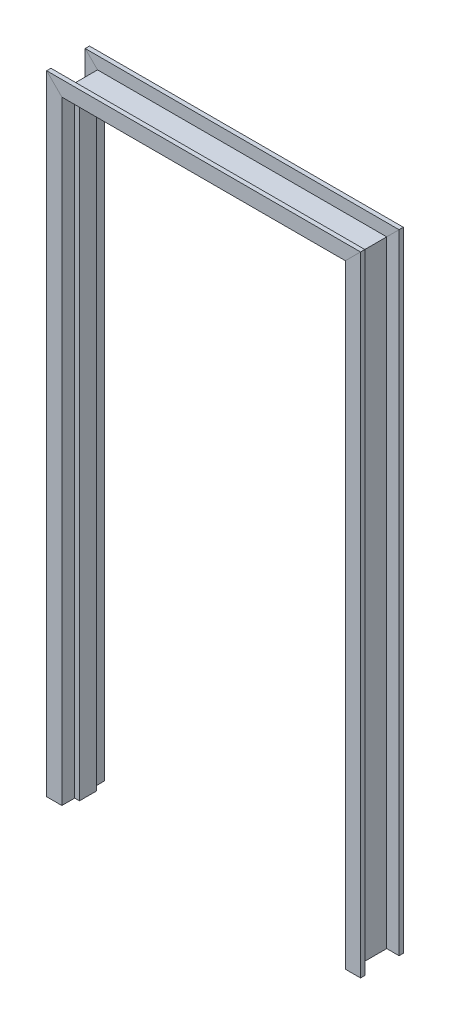
ISO-10303-21;
HEADER;
FILE_DESCRIPTION(('STEP AP214'),'2;1');
FILE_NAME('part.step','',(''),(''),'','','');
FILE_SCHEMA(('AUTOMOTIVE_DESIGN { 1 0 10303 214 1 1 1 1 }'));
ENDSEC;
DATA;
#1=APPLICATION_CONTEXT('core data for automotive mechanical design processes');
#2=APPLICATION_PROTOCOL_DEFINITION('international standard','automotive_design',2000,#1);
#3=PRODUCT_CONTEXT('',#1,'mechanical');
#4=PRODUCT('Part','Part','',(#3));
#5=PRODUCT_RELATED_PRODUCT_CATEGORY('part','',(#4));
#6=PRODUCT_DEFINITION_FORMATION('','',#4);
#7=PRODUCT_DEFINITION_CONTEXT('part definition',#1,'design');
#8=PRODUCT_DEFINITION('design','',#6,#7);
#9=PRODUCT_DEFINITION_SHAPE('','',#8);
#10=(LENGTH_UNIT() NAMED_UNIT(*) SI_UNIT(.MILLI.,.METRE.));
#11=(NAMED_UNIT(*) PLANE_ANGLE_UNIT() SI_UNIT($,.RADIAN.));
#12=(NAMED_UNIT(*) SI_UNIT($,.STERADIAN.) SOLID_ANGLE_UNIT());
#13=UNCERTAINTY_MEASURE_WITH_UNIT(LENGTH_MEASURE(1.E-05),#10,'distance_accuracy_value','');
#14=(GEOMETRIC_REPRESENTATION_CONTEXT(3) GLOBAL_UNCERTAINTY_ASSIGNED_CONTEXT((#13)) GLOBAL_UNIT_ASSIGNED_CONTEXT((#10,
#11,#12)) REPRESENTATION_CONTEXT('',''));
#15=CARTESIAN_POINT('',(0.,0.,0.));
#16=DIRECTION('',(0.,0.,1.));
#17=DIRECTION('',(1.,0.,0.));
#18=AXIS2_PLACEMENT_3D('',#15,#16,#17);
#19=CARTESIAN_POINT('',(914.4,0.,0.));
#20=DIRECTION('',(0.,-1.,0.));
#21=DIRECTION('',(0.,0.,1.));
#22=AXIS2_PLACEMENT_3D('',#19,#20,#21);
#23=PLANE('',#22);
#24=DIRECTION('',(-1.,0.,0.));
#25=VECTOR('',#24,1.);
#26=CARTESIAN_POINT('',(930.275,0.,0.));
#27=LINE('',#26,#25);
#28=CARTESIAN_POINT('',(930.275,0.,0.));
#29=VERTEX_POINT('',#28);
#30=CARTESIAN_POINT('',(914.4,0.,0.));
#31=VERTEX_POINT('',#30);
#32=EDGE_CURVE('E130',#29,#31,#27,.T.);
#33=ORIENTED_EDGE('',*,*,#32,.T.);
#34=DIRECTION('',(0.,0.,-1.));
#35=VECTOR('',#34,1.);
#36=CARTESIAN_POINT('',(914.4,0.,0.));
#37=LINE('',#36,#35);
#38=CARTESIAN_POINT('',(914.4,0.,-57.15));
#39=VERTEX_POINT('',#38);
#40=EDGE_CURVE('E149',#31,#39,#37,.T.);
#41=ORIENTED_EDGE('',*,*,#40,.T.);
#42=DIRECTION('',(1.,0.,0.));
#43=VECTOR('',#42,1.);
#44=CARTESIAN_POINT('',(914.4,0.,-57.15));
#45=LINE('',#44,#43);
#46=CARTESIAN_POINT('',(930.275,0.,-57.15));
#47=VERTEX_POINT('',#46);
#48=EDGE_CURVE('E188',#39,#47,#45,.T.);
#49=ORIENTED_EDGE('',*,*,#48,.T.);
#50=DIRECTION('',(0.,0.,-1.));
#51=VECTOR('',#50,1.);
#52=CARTESIAN_POINT('',(930.275,0.,-57.15));
#53=LINE('',#52,#51);
#54=CARTESIAN_POINT('',(930.275,0.,-100.0125));
#55=VERTEX_POINT('',#54);
#56=EDGE_CURVE('E190',#47,#55,#53,.T.);
#57=ORIENTED_EDGE('',*,*,#56,.T.);
#58=DIRECTION('',(1.,0.,0.));
#59=VECTOR('',#58,1.);
#60=CARTESIAN_POINT('',(930.275,0.,-100.0125));
#61=LINE('',#60,#59);
#62=CARTESIAN_POINT('',(981.075,0.,-100.0125));
#63=VERTEX_POINT('',#62);
#64=EDGE_CURVE('E192',#55,#63,#61,.T.);
#65=ORIENTED_EDGE('',*,*,#64,.T.);
#66=DIRECTION('',(0.,0.,1.));
#67=VECTOR('',#66,1.);
#68=CARTESIAN_POINT('',(981.075,0.,-100.0125));
#69=LINE('',#68,#67);
#70=CARTESIAN_POINT('',(981.075,0.,-85.725));
#71=VERTEX_POINT('',#70);
#72=EDGE_CURVE('E194',#63,#71,#69,.T.);
#73=ORIENTED_EDGE('',*,*,#72,.T.);
#74=DIRECTION('',(-1.,0.,0.));
#75=VECTOR('',#74,1.);
#76=CARTESIAN_POINT('',(981.075,0.,-85.725));
#77=LINE('',#76,#75);
#78=CARTESIAN_POINT('',(939.799999999999,0.,-85.725));
#79=VERTEX_POINT('',#78);
#80=EDGE_CURVE('E196',#71,#79,#77,.T.);
#81=ORIENTED_EDGE('',*,*,#80,.T.);
#82=DIRECTION('',(0.,0.,1.));
#83=VECTOR('',#82,1.);
#84=CARTESIAN_POINT('',(939.799999999999,0.,-85.725));
#85=LINE('',#84,#83);
#86=CARTESIAN_POINT('',(939.799999999999,0.,28.575));
#87=VERTEX_POINT('',#86);
#88=EDGE_CURVE('E198',#79,#87,#85,.T.);
#89=ORIENTED_EDGE('',*,*,#88,.T.);
#90=DIRECTION('',(1.,0.,0.));
#91=VECTOR('',#90,1.);
#92=CARTESIAN_POINT('',(939.799999999999,0.,28.575));
#93=LINE('',#92,#91);
#94=CARTESIAN_POINT('',(981.075,0.,28.575));
#95=VERTEX_POINT('',#94);
#96=EDGE_CURVE('E200',#87,#95,#93,.T.);
#97=ORIENTED_EDGE('',*,*,#96,.T.);
#98=DIRECTION('',(0.,0.,1.));
#99=VECTOR('',#98,1.);
#100=CARTESIAN_POINT('',(981.075,0.,28.575));
#101=LINE('',#100,#99);
#102=CARTESIAN_POINT('',(981.075,0.,42.8625));
#103=VERTEX_POINT('',#102);
#104=EDGE_CURVE('E202',#95,#103,#101,.T.);
#105=ORIENTED_EDGE('',*,*,#104,.T.);
#106=DIRECTION('',(-1.,0.,0.));
#107=VECTOR('',#106,1.);
#108=CARTESIAN_POINT('',(981.075,0.,42.8625));
#109=LINE('',#108,#107);
#110=CARTESIAN_POINT('',(930.275,0.,42.8625));
#111=VERTEX_POINT('',#110);
#112=EDGE_CURVE('E135',#103,#111,#109,.T.);
#113=ORIENTED_EDGE('',*,*,#112,.T.);
#114=DIRECTION('',(0.,0.,-1.));
#115=VECTOR('',#114,1.);
#116=CARTESIAN_POINT('',(930.275,0.,42.8625));
#117=LINE('',#116,#115);
#118=EDGE_CURVE('E133',#111,#29,#117,.T.);
#119=ORIENTED_EDGE('',*,*,#118,.T.);
#120=EDGE_LOOP('',(#33,#41,#49,#57,#65,#73,#81,#89,#97,#105,#113,#119));
#121=FACE_BOUND('',#120,.T.);
#122=ADVANCED_FACE('F36',(#121),#23,.T.);
#123=CARTESIAN_POINT('',(0.,0.,0.));
#124=DIRECTION('',(0.,1.,0.));
#125=DIRECTION('',(0.,0.,1.));
#126=AXIS2_PLACEMENT_3D('',#123,#124,#125);
#127=PLANE('',#126);
#128=DIRECTION('',(1.,0.,0.));
#129=VECTOR('',#128,1.);
#130=CARTESIAN_POINT('',(-15.875,0.,0.));
#131=LINE('',#130,#129);
#132=CARTESIAN_POINT('',(-15.875,0.,0.));
#133=VERTEX_POINT('',#132);
#134=CARTESIAN_POINT('',(0.,0.,0.));
#135=VERTEX_POINT('',#134);
#136=EDGE_CURVE('E269',#133,#135,#131,.T.);
#137=ORIENTED_EDGE('',*,*,#136,.F.);
#138=DIRECTION('',(0.,0.,-1.));
#139=VECTOR('',#138,1.);
#140=CARTESIAN_POINT('',(-15.875,0.,42.8625));
#141=LINE('',#140,#139);
#142=CARTESIAN_POINT('',(-15.875,0.,42.8625));
#143=VERTEX_POINT('',#142);
#144=EDGE_CURVE('E275',#143,#133,#141,.T.);
#145=ORIENTED_EDGE('',*,*,#144,.F.);
#146=DIRECTION('',(1.,0.,0.));
#147=VECTOR('',#146,1.);
#148=CARTESIAN_POINT('',(-66.675,0.,42.8625));
#149=LINE('',#148,#147);
#150=CARTESIAN_POINT('',(-66.675,0.,42.8625));
#151=VERTEX_POINT('',#150);
#152=EDGE_CURVE('E279',#151,#143,#149,.T.);
#153=ORIENTED_EDGE('',*,*,#152,.F.);
#154=DIRECTION('',(0.,0.,1.));
#155=VECTOR('',#154,1.);
#156=CARTESIAN_POINT('',(-66.675,0.,28.575));
#157=LINE('',#156,#155);
#158=CARTESIAN_POINT('',(-66.675,0.,28.575));
#159=VERTEX_POINT('',#158);
#160=EDGE_CURVE('E285',#159,#151,#157,.T.);
#161=ORIENTED_EDGE('',*,*,#160,.F.);
#162=DIRECTION('',(-1.,0.,0.));
#163=VECTOR('',#162,1.);
#164=CARTESIAN_POINT('',(-25.4,0.,28.575));
#165=LINE('',#164,#163);
#166=CARTESIAN_POINT('',(-25.4,0.,28.575));
#167=VERTEX_POINT('',#166);
#168=EDGE_CURVE('E291',#167,#159,#165,.T.);
#169=ORIENTED_EDGE('',*,*,#168,.F.);
#170=DIRECTION('',(0.,0.,1.));
#171=VECTOR('',#170,1.);
#172=CARTESIAN_POINT('',(-25.4,0.,-85.725));
#173=LINE('',#172,#171);
#174=CARTESIAN_POINT('',(-25.4,0.,-85.725));
#175=VERTEX_POINT('',#174);
#176=EDGE_CURVE('E297',#175,#167,#173,.T.);
#177=ORIENTED_EDGE('',*,*,#176,.F.);
#178=DIRECTION('',(1.,0.,0.));
#179=VECTOR('',#178,1.);
#180=CARTESIAN_POINT('',(-66.675,0.,-85.725));
#181=LINE('',#180,#179);
#182=CARTESIAN_POINT('',(-66.675,0.,-85.725));
#183=VERTEX_POINT('',#182);
#184=EDGE_CURVE('E303',#183,#175,#181,.T.);
#185=ORIENTED_EDGE('',*,*,#184,.F.);
#186=DIRECTION('',(0.,0.,1.));
#187=VECTOR('',#186,1.);
#188=CARTESIAN_POINT('',(-66.675,0.,-100.0125));
#189=LINE('',#188,#187);
#190=CARTESIAN_POINT('',(-66.675,0.,-100.0125));
#191=VERTEX_POINT('',#190);
#192=EDGE_CURVE('E309',#191,#183,#189,.T.);
#193=ORIENTED_EDGE('',*,*,#192,.F.);
#194=DIRECTION('',(-1.,0.,0.));
#195=VECTOR('',#194,1.);
#196=CARTESIAN_POINT('',(-15.875,0.,-100.0125));
#197=LINE('',#196,#195);
#198=CARTESIAN_POINT('',(-15.875,0.,-100.0125));
#199=VERTEX_POINT('',#198);
#200=EDGE_CURVE('E315',#199,#191,#197,.T.);
#201=ORIENTED_EDGE('',*,*,#200,.F.);
#202=DIRECTION('',(0.,0.,-1.));
#203=VECTOR('',#202,1.);
#204=CARTESIAN_POINT('',(-15.875,0.,-57.15));
#205=LINE('',#204,#203);
#206=CARTESIAN_POINT('',(-15.875,0.,-57.15));
#207=VERTEX_POINT('',#206);
#208=EDGE_CURVE('E321',#207,#199,#205,.T.);
#209=ORIENTED_EDGE('',*,*,#208,.F.);
#210=DIRECTION('',(-1.,0.,0.));
#211=VECTOR('',#210,1.);
#212=CARTESIAN_POINT('',(0.,0.,-57.15));
#213=LINE('',#212,#211);
#214=CARTESIAN_POINT('',(0.,0.,-57.15));
#215=VERTEX_POINT('',#214);
#216=EDGE_CURVE('E327',#215,#207,#213,.T.);
#217=ORIENTED_EDGE('',*,*,#216,.F.);
#218=DIRECTION('',(0.,0.,-1.));
#219=VECTOR('',#218,1.);
#220=CARTESIAN_POINT('',(0.,0.,0.));
#221=LINE('',#220,#219);
#222=EDGE_CURVE('E333',#135,#215,#221,.T.);
#223=ORIENTED_EDGE('',*,*,#222,.F.);
#224=EDGE_LOOP('',(#137,#145,#153,#161,#169,#177,#185,#193,#201,#209,#217,#223));
#225=FACE_BOUND('',#224,.T.);
#226=ADVANCED_FACE('F390',(#225),#127,.F.);
#227=CARTESIAN_POINT('',(930.274999999999,2105.4425,0.));
#228=DIRECTION('',(0.,0.,1.));
#229=DIRECTION('',(1.,0.,0.));
#230=AXIS2_PLACEMENT_3D('',#227,#228,#229);
#231=PLANE('',#230);
#232=DIRECTION('',(0.707106781186548,0.707106781186548,0.));
#233=VECTOR('',#232,1.);
#234=CARTESIAN_POINT('',(428.41625,1546.01625,0.));
#235=LINE('',#234,#233);
#236=CARTESIAN_POINT('',(914.399999999999,2032.,0.));
#237=VERTEX_POINT('',#236);
#238=CARTESIAN_POINT('',(930.274999999999,2047.875,0.));
#239=VERTEX_POINT('',#238);
#240=EDGE_CURVE('E205',#237,#239,#235,.T.);
#241=ORIENTED_EDGE('',*,*,#240,.F.);
#242=DIRECTION('',(0.,-1.,0.));
#243=VECTOR('',#242,1.);
#244=CARTESIAN_POINT('',(914.399999999999,2105.4425,0.));
#245=LINE('',#244,#243);
#246=EDGE_CURVE('E147',#237,#31,#245,.T.);
#247=ORIENTED_EDGE('',*,*,#246,.T.);
#248=ORIENTED_EDGE('',*,*,#32,.F.);
#249=DIRECTION('',(0.,-1.,0.));
#250=VECTOR('',#249,1.);
#251=CARTESIAN_POINT('',(930.274999999999,2105.4425,0.));
#252=LINE('',#251,#250);
#253=EDGE_CURVE('E39',#239,#29,#252,.T.);
#254=ORIENTED_EDGE('',*,*,#253,.F.);
#255=EDGE_LOOP('',(#241,#247,#248,#254));
#256=FACE_BOUND('',#255,.T.);
#257=ADVANCED_FACE('F144',(#256),#231,.T.);
#258=CARTESIAN_POINT('',(914.399999999999,2105.4425,0.));
#259=DIRECTION('',(-1.,0.,0.));
#260=DIRECTION('',(0.,-1.,0.));
#261=AXIS2_PLACEMENT_3D('',#258,#259,#260);
#262=PLANE('',#261);
#263=DIRECTION('',(0.,0.,1.));
#264=VECTOR('',#263,1.);
#265=CARTESIAN_POINT('',(914.4,2032.,0.));
#266=LINE('',#265,#264);
#267=CARTESIAN_POINT('',(914.399999999999,2032.,-57.15));
#268=VERTEX_POINT('',#267);
#269=EDGE_CURVE('E266',#268,#237,#266,.T.);
#270=ORIENTED_EDGE('',*,*,#269,.F.);
#271=DIRECTION('',(0.,-1.,0.));
#272=VECTOR('',#271,1.);
#273=CARTESIAN_POINT('',(914.399999999999,2105.4425,-57.15));
#274=LINE('',#273,#272);
#275=EDGE_CURVE('E158',#268,#39,#274,.T.);
#276=ORIENTED_EDGE('',*,*,#275,.T.);
#277=ORIENTED_EDGE('',*,*,#40,.F.);
#278=ORIENTED_EDGE('',*,*,#246,.F.);
#279=EDGE_LOOP('',(#270,#276,#277,#278));
#280=FACE_BOUND('',#279,.T.);
#281=ADVANCED_FACE('F524',(#280),#262,.T.);
#282=CARTESIAN_POINT('',(914.399999999999,2105.4425,-57.15));
#283=DIRECTION('',(0.,0.,-1.));
#284=DIRECTION('',(-1.,0.,0.));
#285=AXIS2_PLACEMENT_3D('',#282,#283,#284);
#286=PLANE('',#285);
#287=DIRECTION('',(-0.707106781186548,-0.707106781186548,0.));
#288=VECTOR('',#287,1.);
#289=CARTESIAN_POINT('',(420.47875,1538.07875,-57.15));
#290=LINE('',#289,#288);
#291=CARTESIAN_POINT('',(930.275,2047.875,-57.15));
#292=VERTEX_POINT('',#291);
#293=EDGE_CURVE('E263',#292,#268,#290,.T.);
#294=ORIENTED_EDGE('',*,*,#293,.F.);
#295=DIRECTION('',(0.,-1.,0.));
#296=VECTOR('',#295,1.);
#297=CARTESIAN_POINT('',(930.274999999999,2105.4425,-57.15));
#298=LINE('',#297,#296);
#299=EDGE_CURVE('E160',#292,#47,#298,.T.);
#300=ORIENTED_EDGE('',*,*,#299,.T.);
#301=ORIENTED_EDGE('',*,*,#48,.F.);
#302=ORIENTED_EDGE('',*,*,#275,.F.);
#303=EDGE_LOOP('',(#294,#300,#301,#302));
#304=FACE_BOUND('',#303,.T.);
#305=ADVANCED_FACE('F530',(#304),#286,.T.);
#306=CARTESIAN_POINT('',(930.274999999999,2105.4425,-57.15));
#307=DIRECTION('',(-1.,0.,0.));
#308=DIRECTION('',(0.,-1.,0.));
#309=AXIS2_PLACEMENT_3D('',#306,#307,#308);
#310=PLANE('',#309);
#311=DIRECTION('',(0.,0.,1.));
#312=VECTOR('',#311,1.);
#313=CARTESIAN_POINT('',(930.274999999999,2047.875,-57.15));
#314=LINE('',#313,#312);
#315=CARTESIAN_POINT('',(930.274999999999,2047.875,-100.0125));
#316=VERTEX_POINT('',#315);
#317=EDGE_CURVE('E260',#316,#292,#314,.T.);
#318=ORIENTED_EDGE('',*,*,#317,.F.);
#319=DIRECTION('',(0.,-1.,0.));
#320=VECTOR('',#319,1.);
#321=CARTESIAN_POINT('',(930.274999999999,2105.4425,-100.0125));
#322=LINE('',#321,#320);
#323=EDGE_CURVE('E165',#316,#55,#322,.T.);
#324=ORIENTED_EDGE('',*,*,#323,.T.);
#325=ORIENTED_EDGE('',*,*,#56,.F.);
#326=ORIENTED_EDGE('',*,*,#299,.F.);
#327=EDGE_LOOP('',(#318,#324,#325,#326));
#328=FACE_BOUND('',#327,.T.);
#329=ADVANCED_FACE('F534',(#328),#310,.T.);
#330=CARTESIAN_POINT('',(930.274999999999,2105.4425,-100.0125));
#331=DIRECTION('',(0.,0.,-1.));
#332=DIRECTION('',(-1.,0.,0.));
#333=AXIS2_PLACEMENT_3D('',#330,#331,#332);
#334=PLANE('',#333);
#335=DIRECTION('',(-0.707106781186548,-0.707106781186548,0.));
#336=VECTOR('',#335,1.);
#337=CARTESIAN_POINT('',(428.41625,1546.01625,-100.0125));
#338=LINE('',#337,#336);
#339=CARTESIAN_POINT('',(981.074999999999,2098.675,-100.0125));
#340=VERTEX_POINT('',#339);
#341=EDGE_CURVE('E257',#340,#316,#338,.T.);
#342=ORIENTED_EDGE('',*,*,#341,.F.);
#343=DIRECTION('',(0.,-1.,0.));
#344=VECTOR('',#343,1.);
#345=CARTESIAN_POINT('',(981.074999999999,2105.4425,-100.0125));
#346=LINE('',#345,#344);
#347=EDGE_CURVE('E168',#340,#63,#346,.T.);
#348=ORIENTED_EDGE('',*,*,#347,.T.);
#349=ORIENTED_EDGE('',*,*,#64,.F.);
#350=ORIENTED_EDGE('',*,*,#323,.F.);
#351=EDGE_LOOP('',(#342,#348,#349,#350));
#352=FACE_BOUND('',#351,.T.);
#353=ADVANCED_FACE('F539',(#352),#334,.T.);
#354=CARTESIAN_POINT('',(981.074999999999,2105.4425,-100.0125));
#355=DIRECTION('',(1.,0.,0.));
#356=DIRECTION('',(0.,1.,0.));
#357=AXIS2_PLACEMENT_3D('',#354,#355,#356);
#358=PLANE('',#357);
#359=DIRECTION('',(0.,0.,-1.));
#360=VECTOR('',#359,1.);
#361=CARTESIAN_POINT('',(981.075,2098.675,-100.0125));
#362=LINE('',#361,#360);
#363=CARTESIAN_POINT('',(981.074999999999,2098.675,-85.725));
#364=VERTEX_POINT('',#363);
#365=EDGE_CURVE('E254',#364,#340,#362,.T.);
#366=ORIENTED_EDGE('',*,*,#365,.F.);
#367=DIRECTION('',(0.,-1.,0.));
#368=VECTOR('',#367,1.);
#369=CARTESIAN_POINT('',(981.074999999999,2105.4425,-85.725));
#370=LINE('',#369,#368);
#371=EDGE_CURVE('E171',#364,#71,#370,.T.);
#372=ORIENTED_EDGE('',*,*,#371,.T.);
#373=ORIENTED_EDGE('',*,*,#72,.F.);
#374=ORIENTED_EDGE('',*,*,#347,.F.);
#375=EDGE_LOOP('',(#366,#372,#373,#374));
#376=FACE_BOUND('',#375,.T.);
#377=ADVANCED_FACE('F542',(#376),#358,.T.);
#378=CARTESIAN_POINT('',(981.074999999999,2105.4425,-85.725));
#379=DIRECTION('',(0.,0.,1.));
#380=DIRECTION('',(1.,0.,0.));
#381=AXIS2_PLACEMENT_3D('',#378,#379,#380);
#382=PLANE('',#381);
#383=DIRECTION('',(0.707106781186548,0.707106781186548,0.));
#384=VECTOR('',#383,1.);
#385=CARTESIAN_POINT('',(453.81625,1571.41625,-85.725));
#386=LINE('',#385,#384);
#387=CARTESIAN_POINT('',(939.799999999999,2057.4,-85.725));
#388=VERTEX_POINT('',#387);
#389=EDGE_CURVE('E251',#388,#364,#386,.T.);
#390=ORIENTED_EDGE('',*,*,#389,.F.);
#391=DIRECTION('',(0.,-1.,0.));
#392=VECTOR('',#391,1.);
#393=CARTESIAN_POINT('',(939.799999999999,2105.4425,-85.725));
#394=LINE('',#393,#392);
#395=EDGE_CURVE('E174',#388,#79,#394,.T.);
#396=ORIENTED_EDGE('',*,*,#395,.T.);
#397=ORIENTED_EDGE('',*,*,#80,.F.);
#398=ORIENTED_EDGE('',*,*,#371,.F.);
#399=EDGE_LOOP('',(#390,#396,#397,#398));
#400=FACE_BOUND('',#399,.T.);
#401=ADVANCED_FACE('F493',(#400),#382,.T.);
#402=CARTESIAN_POINT('',(939.799999999999,2105.4425,-85.725));
#403=DIRECTION('',(1.,0.,0.));
#404=DIRECTION('',(0.,0.,-1.));
#405=AXIS2_PLACEMENT_3D('',#402,#403,#404);
#406=PLANE('',#405);
#407=DIRECTION('',(0.,0.,-1.));
#408=VECTOR('',#407,1.);
#409=CARTESIAN_POINT('',(939.799999999999,2057.4,-85.7249999999999));
#410=LINE('',#409,#408);
#411=CARTESIAN_POINT('',(939.799999999999,2057.4,28.575));
#412=VERTEX_POINT('',#411);
#413=EDGE_CURVE('E248',#412,#388,#410,.T.);
#414=ORIENTED_EDGE('',*,*,#413,.F.);
#415=DIRECTION('',(0.,-1.,0.));
#416=VECTOR('',#415,1.);
#417=CARTESIAN_POINT('',(939.799999999999,2105.4425,28.575));
#418=LINE('',#417,#416);
#419=EDGE_CURVE('E177',#412,#87,#418,.T.);
#420=ORIENTED_EDGE('',*,*,#419,.T.);
#421=ORIENTED_EDGE('',*,*,#88,.F.);
#422=ORIENTED_EDGE('',*,*,#395,.F.);
#423=EDGE_LOOP('',(#414,#420,#421,#422));
#424=FACE_BOUND('',#423,.T.);
#425=ADVANCED_FACE('F497',(#424),#406,.T.);
#426=CARTESIAN_POINT('',(939.799999999999,2105.4425,28.575));
#427=DIRECTION('',(0.,0.,-1.));
#428=DIRECTION('',(-1.,0.,0.));
#429=AXIS2_PLACEMENT_3D('',#426,#427,#428);
#430=PLANE('',#429);
#431=DIRECTION('',(-0.707106781186548,-0.707106781186548,0.));
#432=VECTOR('',#431,1.);
#433=CARTESIAN_POINT('',(433.17875,1550.77875,28.575));
#434=LINE('',#433,#432);
#435=CARTESIAN_POINT('',(981.074999999999,2098.675,28.575));
#436=VERTEX_POINT('',#435);
#437=EDGE_CURVE('E245',#436,#412,#434,.T.);
#438=ORIENTED_EDGE('',*,*,#437,.F.);
#439=DIRECTION('',(0.,-1.,0.));
#440=VECTOR('',#439,1.);
#441=CARTESIAN_POINT('',(981.074999999999,2105.4425,28.575));
#442=LINE('',#441,#440);
#443=EDGE_CURVE('E180',#436,#95,#442,.T.);
#444=ORIENTED_EDGE('',*,*,#443,.T.);
#445=ORIENTED_EDGE('',*,*,#96,.F.);
#446=ORIENTED_EDGE('',*,*,#419,.F.);
#447=EDGE_LOOP('',(#438,#444,#445,#446));
#448=FACE_BOUND('',#447,.T.);
#449=ADVANCED_FACE('F507',(#448),#430,.T.);
#450=CARTESIAN_POINT('',(981.074999999999,2105.4425,28.575));
#451=DIRECTION('',(1.,0.,0.));
#452=DIRECTION('',(0.,1.,0.));
#453=AXIS2_PLACEMENT_3D('',#450,#451,#452);
#454=PLANE('',#453);
#455=DIRECTION('',(0.,0.,-1.));
#456=VECTOR('',#455,1.);
#457=CARTESIAN_POINT('',(981.075,2098.675,28.575));
#458=LINE('',#457,#456);
#459=CARTESIAN_POINT('',(981.074999999999,2098.675,42.8625));
#460=VERTEX_POINT('',#459);
#461=EDGE_CURVE('E242',#460,#436,#458,.T.);
#462=ORIENTED_EDGE('',*,*,#461,.F.);
#463=DIRECTION('',(0.,-1.,0.));
#464=VECTOR('',#463,1.);
#465=CARTESIAN_POINT('',(981.074999999999,2105.4425,42.8625));
#466=LINE('',#465,#464);
#467=EDGE_CURVE('E183',#460,#103,#466,.T.);
#468=ORIENTED_EDGE('',*,*,#467,.T.);
#469=ORIENTED_EDGE('',*,*,#104,.F.);
#470=ORIENTED_EDGE('',*,*,#443,.F.);
#471=EDGE_LOOP('',(#462,#468,#469,#470));
#472=FACE_BOUND('',#471,.T.);
#473=ADVANCED_FACE('F511',(#472),#454,.T.);
#474=CARTESIAN_POINT('',(981.074999999999,2105.4425,42.8625));
#475=DIRECTION('',(0.,0.,1.));
#476=DIRECTION('',(1.,0.,0.));
#477=AXIS2_PLACEMENT_3D('',#474,#475,#476);
#478=PLANE('',#477);
#479=DIRECTION('',(0.707106781186548,0.707106781186548,0.));
#480=VECTOR('',#479,1.);
#481=CARTESIAN_POINT('',(453.81625,1571.41625,42.8625000000001));
#482=LINE('',#481,#480);
#483=CARTESIAN_POINT('',(930.275,2047.875,42.8625));
#484=VERTEX_POINT('',#483);
#485=EDGE_CURVE('E239',#484,#460,#482,.T.);
#486=ORIENTED_EDGE('',*,*,#485,.F.);
#487=DIRECTION('',(0.,-1.,0.));
#488=VECTOR('',#487,1.);
#489=CARTESIAN_POINT('',(930.274999999999,2105.4425,42.8625));
#490=LINE('',#489,#488);
#491=EDGE_CURVE('E148',#484,#111,#490,.T.);
#492=ORIENTED_EDGE('',*,*,#491,.T.);
#493=ORIENTED_EDGE('',*,*,#112,.F.);
#494=ORIENTED_EDGE('',*,*,#467,.F.);
#495=EDGE_LOOP('',(#486,#492,#493,#494));
#496=FACE_BOUND('',#495,.T.);
#497=ADVANCED_FACE('F519',(#496),#478,.T.);
#498=CARTESIAN_POINT('',(930.274999999999,2105.4425,42.8625));
#499=DIRECTION('',(-1.,0.,0.));
#500=DIRECTION('',(0.,-1.,0.));
#501=AXIS2_PLACEMENT_3D('',#498,#499,#500);
#502=PLANE('',#501);
#503=DIRECTION('',(0.,0.,1.));
#504=VECTOR('',#503,1.);
#505=CARTESIAN_POINT('',(930.274999999999,2047.875,42.8625));
#506=LINE('',#505,#504);
#507=EDGE_CURVE('E153',#239,#484,#506,.T.);
#508=ORIENTED_EDGE('',*,*,#507,.F.);
#509=ORIENTED_EDGE('',*,*,#253,.T.);
#510=ORIENTED_EDGE('',*,*,#118,.F.);
#511=ORIENTED_EDGE('',*,*,#491,.F.);
#512=EDGE_LOOP('',(#508,#509,#510,#511));
#513=FACE_BOUND('',#512,.T.);
#514=ADVANCED_FACE('F151',(#513),#502,.T.);
#515=CARTESIAN_POINT('',(-73.4424999999996,2047.875,42.8625));
#516=DIRECTION('',(0.,-1.,0.));
#517=DIRECTION('',(0.,0.,-1.));
#518=AXIS2_PLACEMENT_3D('',#515,#516,#517);
#519=PLANE('',#518);
#520=DIRECTION('',(1.,0.,0.));
#521=VECTOR('',#520,1.);
#522=CARTESIAN_POINT('',(-73.4424999999996,2047.875,0.));
#523=LINE('',#522,#521);
#524=CARTESIAN_POINT('',(-15.8749999999997,2047.875,0.));
#525=VERTEX_POINT('',#524);
#526=EDGE_CURVE('E207',#525,#239,#523,.T.);
#527=ORIENTED_EDGE('',*,*,#526,.T.);
#528=ORIENTED_EDGE('',*,*,#507,.T.);
#529=DIRECTION('',(1.,0.,0.));
#530=VECTOR('',#529,1.);
#531=CARTESIAN_POINT('',(-73.4424999999996,2047.875,42.8625));
#532=LINE('',#531,#530);
#533=CARTESIAN_POINT('',(-15.8749999999998,2047.875,42.8625));
#534=VERTEX_POINT('',#533);
#535=EDGE_CURVE('E154',#534,#484,#532,.T.);
#536=ORIENTED_EDGE('',*,*,#535,.F.);
#537=DIRECTION('',(0.,0.,1.));
#538=VECTOR('',#537,1.);
#539=CARTESIAN_POINT('',(-15.875,2047.875,42.8625));
#540=LINE('',#539,#538);
#541=EDGE_CURVE('E273',#525,#534,#540,.T.);
#542=ORIENTED_EDGE('',*,*,#541,.F.);
#543=EDGE_LOOP('',(#527,#528,#536,#542));
#544=FACE_BOUND('',#543,.T.);
#545=ADVANCED_FACE('F520',(#544),#519,.T.);
#546=CARTESIAN_POINT('',(-73.4424999999996,2098.675,42.8625));
#547=DIRECTION('',(0.,0.,1.));
#548=DIRECTION('',(0.,-1.,0.));
#549=AXIS2_PLACEMENT_3D('',#546,#547,#548);
#550=PLANE('',#549);
#551=ORIENTED_EDGE('',*,*,#535,.T.);
#552=ORIENTED_EDGE('',*,*,#485,.T.);
#553=DIRECTION('',(1.,0.,0.));
#554=VECTOR('',#553,1.);
#555=CARTESIAN_POINT('',(-73.4424999999996,2098.675,42.8625));
#556=LINE('',#555,#554);
#557=CARTESIAN_POINT('',(-66.6749999999998,2098.675,42.8625));
#558=VERTEX_POINT('',#557);
#559=EDGE_CURVE('E156',#558,#460,#556,.T.);
#560=ORIENTED_EDGE('',*,*,#559,.F.);
#561=DIRECTION('',(-0.707106781186548,0.707106781186548,0.));
#562=VECTOR('',#561,1.);
#563=CARTESIAN_POINT('',(982.6625,1049.3375,42.8625000000001));
#564=LINE('',#563,#562);
#565=EDGE_CURVE('E347',#534,#558,#564,.T.);
#566=ORIENTED_EDGE('',*,*,#565,.F.);
#567=EDGE_LOOP('',(#551,#552,#560,#566));
#568=FACE_BOUND('',#567,.T.);
#569=ADVANCED_FACE('F517',(#568),#550,.T.);
#570=CARTESIAN_POINT('',(-73.4424999999996,2098.675,28.575));
#571=DIRECTION('',(0.,1.,0.));
#572=DIRECTION('',(0.,0.,1.));
#573=AXIS2_PLACEMENT_3D('',#570,#571,#572);
#574=PLANE('',#573);
#575=ORIENTED_EDGE('',*,*,#559,.T.);
#576=ORIENTED_EDGE('',*,*,#461,.T.);
#577=DIRECTION('',(1.,0.,0.));
#578=VECTOR('',#577,1.);
#579=CARTESIAN_POINT('',(-73.4424999999996,2098.675,28.575));
#580=LINE('',#579,#578);
#581=CARTESIAN_POINT('',(-66.6749999999998,2098.675,28.575));
#582=VERTEX_POINT('',#581);
#583=EDGE_CURVE('E233',#582,#436,#580,.T.);
#584=ORIENTED_EDGE('',*,*,#583,.F.);
#585=DIRECTION('',(0.,0.,-1.));
#586=VECTOR('',#585,1.);
#587=CARTESIAN_POINT('',(-66.675,2098.675,28.575));
#588=LINE('',#587,#586);
#589=EDGE_CURVE('E350',#558,#582,#588,.T.);
#590=ORIENTED_EDGE('',*,*,#589,.F.);
#591=EDGE_LOOP('',(#575,#576,#584,#590));
#592=FACE_BOUND('',#591,.T.);
#593=ADVANCED_FACE('F514',(#592),#574,.T.);
#594=CARTESIAN_POINT('',(-73.4424999999996,2057.4,28.575));
#595=DIRECTION('',(0.,0.,-1.));
#596=DIRECTION('',(-1.,0.,0.));
#597=AXIS2_PLACEMENT_3D('',#594,#595,#596);
#598=PLANE('',#597);
#599=ORIENTED_EDGE('',*,*,#583,.T.);
#600=ORIENTED_EDGE('',*,*,#437,.T.);
#601=DIRECTION('',(1.,0.,0.));
#602=VECTOR('',#601,1.);
#603=CARTESIAN_POINT('',(-73.4424999999996,2057.4,28.575));
#604=LINE('',#603,#602);
#605=CARTESIAN_POINT('',(-25.3999999999997,2057.4,28.575));
#606=VERTEX_POINT('',#605);
#607=EDGE_CURVE('E230',#606,#412,#604,.T.);
#608=ORIENTED_EDGE('',*,*,#607,.F.);
#609=DIRECTION('',(0.707106781186548,-0.707106781186548,0.));
#610=VECTOR('',#609,1.);
#611=CARTESIAN_POINT('',(1003.3,1028.7,28.575));
#612=LINE('',#611,#610);
#613=EDGE_CURVE('E353',#582,#606,#612,.T.);
#614=ORIENTED_EDGE('',*,*,#613,.F.);
#615=EDGE_LOOP('',(#599,#600,#608,#614));
#616=FACE_BOUND('',#615,.T.);
#617=ADVANCED_FACE('F503',(#616),#598,.T.);
#618=CARTESIAN_POINT('',(-73.4424999999996,2057.4,-85.725));
#619=DIRECTION('',(0.,1.,0.));
#620=DIRECTION('',(0.,0.,1.));
#621=AXIS2_PLACEMENT_3D('',#618,#619,#620);
#622=PLANE('',#621);
#623=ORIENTED_EDGE('',*,*,#607,.T.);
#624=ORIENTED_EDGE('',*,*,#413,.T.);
#625=DIRECTION('',(1.,0.,0.));
#626=VECTOR('',#625,1.);
#627=CARTESIAN_POINT('',(-73.4424999999996,2057.4,-85.725));
#628=LINE('',#627,#626);
#629=CARTESIAN_POINT('',(-25.3999999999998,2057.4,-85.725));
#630=VERTEX_POINT('',#629);
#631=EDGE_CURVE('E227',#630,#388,#628,.T.);
#632=ORIENTED_EDGE('',*,*,#631,.F.);
#633=DIRECTION('',(0.,0.,-1.));
#634=VECTOR('',#633,1.);
#635=CARTESIAN_POINT('',(-25.4,2057.4,-85.7249999999998));
#636=LINE('',#635,#634);
#637=EDGE_CURVE('E356',#606,#630,#636,.T.);
#638=ORIENTED_EDGE('',*,*,#637,.F.);
#639=EDGE_LOOP('',(#623,#624,#632,#638));
#640=FACE_BOUND('',#639,.T.);
#641=ADVANCED_FACE('F500',(#640),#622,.T.);
#642=CARTESIAN_POINT('',(-73.4424999999996,2098.675,-85.725));
#643=DIRECTION('',(0.,0.,1.));
#644=DIRECTION('',(1.,0.,0.));
#645=AXIS2_PLACEMENT_3D('',#642,#643,#644);
#646=PLANE('',#645);
#647=ORIENTED_EDGE('',*,*,#631,.T.);
#648=ORIENTED_EDGE('',*,*,#389,.T.);
#649=DIRECTION('',(1.,0.,0.));
#650=VECTOR('',#649,1.);
#651=CARTESIAN_POINT('',(-73.4424999999996,2098.675,-85.725));
#652=LINE('',#651,#650);
#653=CARTESIAN_POINT('',(-66.6749999999998,2098.675,-85.725));
#654=VERTEX_POINT('',#653);
#655=EDGE_CURVE('E224',#654,#364,#652,.T.);
#656=ORIENTED_EDGE('',*,*,#655,.F.);
#657=DIRECTION('',(-0.707106781186548,0.707106781186548,0.));
#658=VECTOR('',#657,1.);
#659=CARTESIAN_POINT('',(982.6625,1049.3375,-85.725));
#660=LINE('',#659,#658);
#661=EDGE_CURVE('E359',#630,#654,#660,.T.);
#662=ORIENTED_EDGE('',*,*,#661,.F.);
#663=EDGE_LOOP('',(#647,#648,#656,#662));
#664=FACE_BOUND('',#663,.T.);
#665=ADVANCED_FACE('F488',(#664),#646,.T.);
#666=CARTESIAN_POINT('',(-73.4424999999996,2098.675,-100.0125));
#667=DIRECTION('',(0.,1.,0.));
#668=DIRECTION('',(0.,0.,1.));
#669=AXIS2_PLACEMENT_3D('',#666,#667,#668);
#670=PLANE('',#669);
#671=ORIENTED_EDGE('',*,*,#655,.T.);
#672=ORIENTED_EDGE('',*,*,#365,.T.);
#673=DIRECTION('',(1.,0.,0.));
#674=VECTOR('',#673,1.);
#675=CARTESIAN_POINT('',(-73.4424999999996,2098.675,-100.0125));
#676=LINE('',#675,#674);
#677=CARTESIAN_POINT('',(-66.6749999999998,2098.675,-100.0125));
#678=VERTEX_POINT('',#677);
#679=EDGE_CURVE('E221',#678,#340,#676,.T.);
#680=ORIENTED_EDGE('',*,*,#679,.F.);
#681=DIRECTION('',(0.,0.,-1.));
#682=VECTOR('',#681,1.);
#683=CARTESIAN_POINT('',(-66.675,2098.675,-100.0125));
#684=LINE('',#683,#682);
#685=EDGE_CURVE('E362',#654,#678,#684,.T.);
#686=ORIENTED_EDGE('',*,*,#685,.F.);
#687=EDGE_LOOP('',(#671,#672,#680,#686));
#688=FACE_BOUND('',#687,.T.);
#689=ADVANCED_FACE('F486',(#688),#670,.T.);
#690=CARTESIAN_POINT('',(-73.4424999999996,2047.875,-100.0125));
#691=DIRECTION('',(0.,0.,-1.));
#692=DIRECTION('',(0.,1.,0.));
#693=AXIS2_PLACEMENT_3D('',#690,#691,#692);
#694=PLANE('',#693);
#695=ORIENTED_EDGE('',*,*,#679,.T.);
#696=ORIENTED_EDGE('',*,*,#341,.T.);
#697=DIRECTION('',(1.,0.,0.));
#698=VECTOR('',#697,1.);
#699=CARTESIAN_POINT('',(-73.4424999999996,2047.875,-100.0125));
#700=LINE('',#699,#698);
#701=CARTESIAN_POINT('',(-15.8749999999997,2047.875,-100.0125));
#702=VERTEX_POINT('',#701);
#703=EDGE_CURVE('E218',#702,#316,#700,.T.);
#704=ORIENTED_EDGE('',*,*,#703,.F.);
#705=DIRECTION('',(0.707106781186548,-0.707106781186548,0.));
#706=VECTOR('',#705,1.);
#707=CARTESIAN_POINT('',(1008.0625,1023.9375,-100.0125));
#708=LINE('',#707,#706);
#709=EDGE_CURVE('E365',#678,#702,#708,.T.);
#710=ORIENTED_EDGE('',*,*,#709,.F.);
#711=EDGE_LOOP('',(#695,#696,#704,#710));
#712=FACE_BOUND('',#711,.T.);
#713=ADVANCED_FACE('F438',(#712),#694,.T.);
#714=CARTESIAN_POINT('',(-73.4424999999996,2047.875,-57.15));
#715=DIRECTION('',(0.,-1.,0.));
#716=DIRECTION('',(0.,0.,-1.));
#717=AXIS2_PLACEMENT_3D('',#714,#715,#716);
#718=PLANE('',#717);
#719=ORIENTED_EDGE('',*,*,#703,.T.);
#720=ORIENTED_EDGE('',*,*,#317,.T.);
#721=DIRECTION('',(1.,0.,0.));
#722=VECTOR('',#721,1.);
#723=CARTESIAN_POINT('',(-73.4424999999996,2047.875,-57.15));
#724=LINE('',#723,#722);
#725=CARTESIAN_POINT('',(-15.8749999999998,2047.875,-57.15));
#726=VERTEX_POINT('',#725);
#727=EDGE_CURVE('E215',#726,#292,#724,.T.);
#728=ORIENTED_EDGE('',*,*,#727,.F.);
#729=DIRECTION('',(0.,0.,1.));
#730=VECTOR('',#729,1.);
#731=CARTESIAN_POINT('',(-15.875,2047.875,-57.15));
#732=LINE('',#731,#730);
#733=EDGE_CURVE('E368',#702,#726,#732,.T.);
#734=ORIENTED_EDGE('',*,*,#733,.F.);
#735=EDGE_LOOP('',(#719,#720,#728,#734));
#736=FACE_BOUND('',#735,.T.);
#737=ADVANCED_FACE('F435',(#736),#718,.T.);
#738=CARTESIAN_POINT('',(-73.4424999999996,2032.,-57.15));
#739=DIRECTION('',(0.,0.,-1.));
#740=DIRECTION('',(-1.,0.,0.));
#741=AXIS2_PLACEMENT_3D('',#738,#739,#740);
#742=PLANE('',#741);
#743=ORIENTED_EDGE('',*,*,#727,.T.);
#744=ORIENTED_EDGE('',*,*,#293,.T.);
#745=DIRECTION('',(1.,0.,0.));
#746=VECTOR('',#745,1.);
#747=CARTESIAN_POINT('',(-73.4424999999996,2032.,-57.15));
#748=LINE('',#747,#746);
#749=CARTESIAN_POINT('',(2.22044604925031E-13,2032.,-57.15));
#750=VERTEX_POINT('',#749);
#751=EDGE_CURVE('E213',#750,#268,#748,.T.);
#752=ORIENTED_EDGE('',*,*,#751,.F.);
#753=DIRECTION('',(0.707106781186548,-0.707106781186548,0.));
#754=VECTOR('',#753,1.);
#755=CARTESIAN_POINT('',(1016.,1016.,-57.15));
#756=LINE('',#755,#754);
#757=EDGE_CURVE('E45',#726,#750,#756,.T.);
#758=ORIENTED_EDGE('',*,*,#757,.F.);
#759=EDGE_LOOP('',(#743,#744,#752,#758));
#760=FACE_BOUND('',#759,.T.);
#761=ADVANCED_FACE('F527',(#760),#742,.T.);
#762=CARTESIAN_POINT('',(-73.4424999999996,2032.,0.));
#763=DIRECTION('',(0.,-1.,0.));
#764=DIRECTION('',(0.,0.,-1.));
#765=AXIS2_PLACEMENT_3D('',#762,#763,#764);
#766=PLANE('',#765);
#767=ORIENTED_EDGE('',*,*,#751,.T.);
#768=ORIENTED_EDGE('',*,*,#269,.T.);
#769=DIRECTION('',(1.,0.,0.));
#770=VECTOR('',#769,1.);
#771=CARTESIAN_POINT('',(-73.4424999999996,2032.,0.));
#772=LINE('',#771,#770);
#773=CARTESIAN_POINT('',(2.37657116208823E-13,2032.,0.));
#774=VERTEX_POINT('',#773);
#775=EDGE_CURVE('E210',#774,#237,#772,.T.);
#776=ORIENTED_EDGE('',*,*,#775,.F.);
#777=DIRECTION('',(0.,0.,1.));
#778=VECTOR('',#777,1.);
#779=CARTESIAN_POINT('',(0.,2032.,0.));
#780=LINE('',#779,#778);
#781=EDGE_CURVE('E11',#750,#774,#780,.T.);
#782=ORIENTED_EDGE('',*,*,#781,.F.);
#783=EDGE_LOOP('',(#767,#768,#776,#782));
#784=FACE_BOUND('',#783,.T.);
#785=ADVANCED_FACE('F526',(#784),#766,.T.);
#786=CARTESIAN_POINT('',(-73.4424999999996,2047.875,0.));
#787=DIRECTION('',(0.,0.,1.));
#788=DIRECTION('',(0.,-1.,0.));
#789=AXIS2_PLACEMENT_3D('',#786,#787,#788);
#790=PLANE('',#789);
#791=ORIENTED_EDGE('',*,*,#775,.T.);
#792=ORIENTED_EDGE('',*,*,#240,.T.);
#793=ORIENTED_EDGE('',*,*,#526,.F.);
#794=DIRECTION('',(-0.707106781186548,0.707106781186548,0.));
#795=VECTOR('',#794,1.);
#796=CARTESIAN_POINT('',(1008.0625,1023.9375,0.));
#797=LINE('',#796,#795);
#798=EDGE_CURVE('E270',#774,#525,#797,.T.);
#799=ORIENTED_EDGE('',*,*,#798,.F.);
#800=EDGE_LOOP('',(#791,#792,#793,#799));
#801=FACE_BOUND('',#800,.T.);
#802=ADVANCED_FACE('F522',(#801),#790,.T.);
#803=CARTESIAN_POINT('',(-15.875,0.,42.8625));
#804=DIRECTION('',(1.,0.,0.));
#805=DIRECTION('',(0.,0.,-1.));
#806=AXIS2_PLACEMENT_3D('',#803,#804,#805);
#807=PLANE('',#806);
#808=DIRECTION('',(0.,1.,0.));
#809=VECTOR('',#808,1.);
#810=CARTESIAN_POINT('',(-15.875,0.,0.));
#811=LINE('',#810,#809);
#812=EDGE_CURVE('E278',#133,#525,#811,.T.);
#813=ORIENTED_EDGE('',*,*,#812,.T.);
#814=ORIENTED_EDGE('',*,*,#541,.T.);
#815=DIRECTION('',(0.,1.,0.));
#816=VECTOR('',#815,1.);
#817=CARTESIAN_POINT('',(-15.875,0.,42.8625));
#818=LINE('',#817,#816);
#819=EDGE_CURVE('E274',#143,#534,#818,.T.);
#820=ORIENTED_EDGE('',*,*,#819,.F.);
#821=ORIENTED_EDGE('',*,*,#144,.T.);
#822=EDGE_LOOP('',(#813,#814,#820,#821));
#823=FACE_BOUND('',#822,.T.);
#824=ADVANCED_FACE('F401',(#823),#807,.T.);
#825=CARTESIAN_POINT('',(-66.675,0.,42.8625));
#826=DIRECTION('',(0.,0.,1.));
#827=DIRECTION('',(1.,0.,0.));
#828=AXIS2_PLACEMENT_3D('',#825,#826,#827);
#829=PLANE('',#828);
#830=ORIENTED_EDGE('',*,*,#819,.T.);
#831=ORIENTED_EDGE('',*,*,#565,.T.);
#832=DIRECTION('',(0.,1.,0.));
#833=VECTOR('',#832,1.);
#834=CARTESIAN_POINT('',(-66.675,0.,42.8625));
#835=LINE('',#834,#833);
#836=EDGE_CURVE('E282',#151,#558,#835,.T.);
#837=ORIENTED_EDGE('',*,*,#836,.F.);
#838=ORIENTED_EDGE('',*,*,#152,.T.);
#839=EDGE_LOOP('',(#830,#831,#837,#838));
#840=FACE_BOUND('',#839,.T.);
#841=ADVANCED_FACE('F469',(#840),#829,.T.);
#842=CARTESIAN_POINT('',(-66.675,0.,28.575));
#843=DIRECTION('',(-1.,0.,0.));
#844=DIRECTION('',(0.,0.,1.));
#845=AXIS2_PLACEMENT_3D('',#842,#843,#844);
#846=PLANE('',#845);
#847=ORIENTED_EDGE('',*,*,#836,.T.);
#848=ORIENTED_EDGE('',*,*,#589,.T.);
#849=DIRECTION('',(0.,1.,0.));
#850=VECTOR('',#849,1.);
#851=CARTESIAN_POINT('',(-66.675,0.,28.575));
#852=LINE('',#851,#850);
#853=EDGE_CURVE('E288',#159,#582,#852,.T.);
#854=ORIENTED_EDGE('',*,*,#853,.F.);
#855=ORIENTED_EDGE('',*,*,#160,.T.);
#856=EDGE_LOOP('',(#847,#848,#854,#855));
#857=FACE_BOUND('',#856,.T.);
#858=ADVANCED_FACE('F471',(#857),#846,.T.);
#859=CARTESIAN_POINT('',(-25.4,0.,28.575));
#860=DIRECTION('',(0.,0.,-1.));
#861=DIRECTION('',(-1.,0.,0.));
#862=AXIS2_PLACEMENT_3D('',#859,#860,#861);
#863=PLANE('',#862);
#864=ORIENTED_EDGE('',*,*,#853,.T.);
#865=ORIENTED_EDGE('',*,*,#613,.T.);
#866=DIRECTION('',(0.,1.,0.));
#867=VECTOR('',#866,1.);
#868=CARTESIAN_POINT('',(-25.4,0.,28.575));
#869=LINE('',#868,#867);
#870=EDGE_CURVE('E294',#167,#606,#869,.T.);
#871=ORIENTED_EDGE('',*,*,#870,.F.);
#872=ORIENTED_EDGE('',*,*,#168,.T.);
#873=EDGE_LOOP('',(#864,#865,#871,#872));
#874=FACE_BOUND('',#873,.T.);
#875=ADVANCED_FACE('F475',(#874),#863,.T.);
#876=CARTESIAN_POINT('',(-25.4,0.,-85.725));
#877=DIRECTION('',(-1.,0.,0.));
#878=DIRECTION('',(0.,0.,1.));
#879=AXIS2_PLACEMENT_3D('',#876,#877,#878);
#880=PLANE('',#879);
#881=ORIENTED_EDGE('',*,*,#870,.T.);
#882=ORIENTED_EDGE('',*,*,#637,.T.);
#883=DIRECTION('',(0.,1.,0.));
#884=VECTOR('',#883,1.);
#885=CARTESIAN_POINT('',(-25.4,0.,-85.725));
#886=LINE('',#885,#884);
#887=EDGE_CURVE('E300',#175,#630,#886,.T.);
#888=ORIENTED_EDGE('',*,*,#887,.F.);
#889=ORIENTED_EDGE('',*,*,#176,.T.);
#890=EDGE_LOOP('',(#881,#882,#888,#889));
#891=FACE_BOUND('',#890,.T.);
#892=ADVANCED_FACE('F477',(#891),#880,.T.);
#893=CARTESIAN_POINT('',(-66.675,0.,-85.725));
#894=DIRECTION('',(0.,0.,1.));
#895=DIRECTION('',(1.,0.,0.));
#896=AXIS2_PLACEMENT_3D('',#893,#894,#895);
#897=PLANE('',#896);
#898=ORIENTED_EDGE('',*,*,#887,.T.);
#899=ORIENTED_EDGE('',*,*,#661,.T.);
#900=DIRECTION('',(0.,1.,0.));
#901=VECTOR('',#900,1.);
#902=CARTESIAN_POINT('',(-66.675,0.,-85.725));
#903=LINE('',#902,#901);
#904=EDGE_CURVE('E306',#183,#654,#903,.T.);
#905=ORIENTED_EDGE('',*,*,#904,.F.);
#906=ORIENTED_EDGE('',*,*,#184,.T.);
#907=EDGE_LOOP('',(#898,#899,#905,#906));
#908=FACE_BOUND('',#907,.T.);
#909=ADVANCED_FACE('F481',(#908),#897,.T.);
#910=CARTESIAN_POINT('',(-66.675,0.,-100.0125));
#911=DIRECTION('',(-1.,0.,0.));
#912=DIRECTION('',(0.,0.,1.));
#913=AXIS2_PLACEMENT_3D('',#910,#911,#912);
#914=PLANE('',#913);
#915=ORIENTED_EDGE('',*,*,#904,.T.);
#916=ORIENTED_EDGE('',*,*,#685,.T.);
#917=DIRECTION('',(0.,1.,0.));
#918=VECTOR('',#917,1.);
#919=CARTESIAN_POINT('',(-66.675,0.,-100.0125));
#920=LINE('',#919,#918);
#921=EDGE_CURVE('E312',#191,#678,#920,.T.);
#922=ORIENTED_EDGE('',*,*,#921,.F.);
#923=ORIENTED_EDGE('',*,*,#192,.T.);
#924=EDGE_LOOP('',(#915,#916,#922,#923));
#925=FACE_BOUND('',#924,.T.);
#926=ADVANCED_FACE('F483',(#925),#914,.T.);
#927=CARTESIAN_POINT('',(-15.875,0.,-100.0125));
#928=DIRECTION('',(0.,0.,-1.));
#929=DIRECTION('',(-1.,0.,0.));
#930=AXIS2_PLACEMENT_3D('',#927,#928,#929);
#931=PLANE('',#930);
#932=ORIENTED_EDGE('',*,*,#921,.T.);
#933=ORIENTED_EDGE('',*,*,#709,.T.);
#934=DIRECTION('',(0.,1.,0.));
#935=VECTOR('',#934,1.);
#936=CARTESIAN_POINT('',(-15.875,0.,-100.0125));
#937=LINE('',#936,#935);
#938=EDGE_CURVE('E318',#199,#702,#937,.T.);
#939=ORIENTED_EDGE('',*,*,#938,.F.);
#940=ORIENTED_EDGE('',*,*,#200,.T.);
#941=EDGE_LOOP('',(#932,#933,#939,#940));
#942=FACE_BOUND('',#941,.T.);
#943=ADVANCED_FACE('F442',(#942),#931,.T.);
#944=CARTESIAN_POINT('',(-15.875,0.,-57.15));
#945=DIRECTION('',(1.,0.,0.));
#946=DIRECTION('',(0.,0.,-1.));
#947=AXIS2_PLACEMENT_3D('',#944,#945,#946);
#948=PLANE('',#947);
#949=ORIENTED_EDGE('',*,*,#938,.T.);
#950=ORIENTED_EDGE('',*,*,#733,.T.);
#951=DIRECTION('',(0.,1.,0.));
#952=VECTOR('',#951,1.);
#953=CARTESIAN_POINT('',(-15.875,0.,-57.15));
#954=LINE('',#953,#952);
#955=EDGE_CURVE('E324',#207,#726,#954,.T.);
#956=ORIENTED_EDGE('',*,*,#955,.F.);
#957=ORIENTED_EDGE('',*,*,#208,.T.);
#958=EDGE_LOOP('',(#949,#950,#956,#957));
#959=FACE_BOUND('',#958,.T.);
#960=ADVANCED_FACE('F445',(#959),#948,.T.);
#961=CARTESIAN_POINT('',(0.,0.,-57.15));
#962=DIRECTION('',(0.,0.,-1.));
#963=DIRECTION('',(-1.,0.,0.));
#964=AXIS2_PLACEMENT_3D('',#961,#962,#963);
#965=PLANE('',#964);
#966=ORIENTED_EDGE('',*,*,#955,.T.);
#967=ORIENTED_EDGE('',*,*,#757,.T.);
#968=DIRECTION('',(0.,1.,0.));
#969=VECTOR('',#968,1.);
#970=CARTESIAN_POINT('',(0.,0.,-57.15));
#971=LINE('',#970,#969);
#972=EDGE_CURVE('E330',#215,#750,#971,.T.);
#973=ORIENTED_EDGE('',*,*,#972,.F.);
#974=ORIENTED_EDGE('',*,*,#216,.T.);
#975=EDGE_LOOP('',(#966,#967,#973,#974));
#976=FACE_BOUND('',#975,.T.);
#977=ADVANCED_FACE('F374',(#976),#965,.T.);
#978=CARTESIAN_POINT('',(0.,0.,0.));
#979=DIRECTION('',(1.,0.,0.));
#980=DIRECTION('',(0.,0.,-1.));
#981=AXIS2_PLACEMENT_3D('',#978,#979,#980);
#982=PLANE('',#981);
#983=ORIENTED_EDGE('',*,*,#972,.T.);
#984=ORIENTED_EDGE('',*,*,#781,.T.);
#985=DIRECTION('',(0.,1.,0.));
#986=VECTOR('',#985,1.);
#987=CARTESIAN_POINT('',(0.,0.,0.));
#988=LINE('',#987,#986);
#989=EDGE_CURVE('E336',#135,#774,#988,.T.);
#990=ORIENTED_EDGE('',*,*,#989,.F.);
#991=ORIENTED_EDGE('',*,*,#222,.T.);
#992=EDGE_LOOP('',(#983,#984,#990,#991));
#993=FACE_BOUND('',#992,.T.);
#994=ADVANCED_FACE('F380',(#993),#982,.T.);
#995=CARTESIAN_POINT('',(-15.875,0.,0.));
#996=DIRECTION('',(0.,0.,1.));
#997=DIRECTION('',(1.,0.,0.));
#998=AXIS2_PLACEMENT_3D('',#995,#996,#997);
#999=PLANE('',#998);
#1000=ORIENTED_EDGE('',*,*,#989,.T.);
#1001=ORIENTED_EDGE('',*,*,#798,.T.);
#1002=ORIENTED_EDGE('',*,*,#812,.F.);
#1003=ORIENTED_EDGE('',*,*,#136,.T.);
#1004=EDGE_LOOP('',(#1000,#1001,#1002,#1003));
#1005=FACE_BOUND('',#1004,.T.);
#1006=ADVANCED_FACE('F396',(#1005),#999,.T.);
#1007=CLOSED_SHELL('',(#122,#226,#257,#281,#305,#329,#353,#377,#401,#425,#449,#473,#497,#514,
#545,#569,#593,#617,#641,#665,#689,#713,#737,#761,#785,#802,#824,#841,#858,#875,#892,#909,#926,
#943,#960,#977,#994,#1006));
#1008=MANIFOLD_SOLID_BREP('B2',#1007);
#1009=ADVANCED_BREP_SHAPE_REPRESENTATION('',(#18,#1008),#14);
#1010=SHAPE_DEFINITION_REPRESENTATION(#9,#1009);
ENDSEC;
END-ISO-10303-21;
